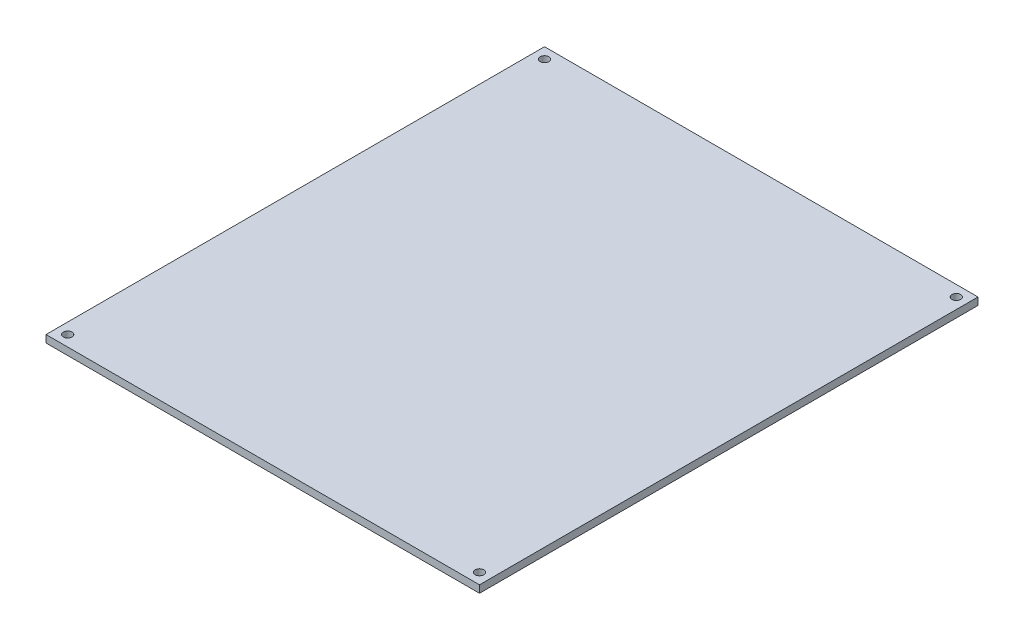
ISO-10303-21;
HEADER;
FILE_DESCRIPTION(('STEP AP214'),'2;1');
FILE_NAME('part.step','',(''),(''),'','','');
FILE_SCHEMA(('AUTOMOTIVE_DESIGN { 1 0 10303 214 1 1 1 1 }'));
ENDSEC;
DATA;
#1=APPLICATION_CONTEXT('core data for automotive mechanical design processes');
#2=APPLICATION_PROTOCOL_DEFINITION('international standard','automotive_design',2000,#1);
#3=PRODUCT_CONTEXT('',#1,'mechanical');
#4=PRODUCT('Part','Part','',(#3));
#5=PRODUCT_RELATED_PRODUCT_CATEGORY('part','',(#4));
#6=PRODUCT_DEFINITION_FORMATION('','',#4);
#7=PRODUCT_DEFINITION_CONTEXT('part definition',#1,'design');
#8=PRODUCT_DEFINITION('design','',#6,#7);
#9=PRODUCT_DEFINITION_SHAPE('','',#8);
#10=(LENGTH_UNIT() NAMED_UNIT(*) SI_UNIT(.MILLI.,.METRE.));
#11=(NAMED_UNIT(*) PLANE_ANGLE_UNIT() SI_UNIT($,.RADIAN.));
#12=(NAMED_UNIT(*) SI_UNIT($,.STERADIAN.) SOLID_ANGLE_UNIT());
#13=UNCERTAINTY_MEASURE_WITH_UNIT(LENGTH_MEASURE(1.E-05),#10,'distance_accuracy_value','');
#14=(GEOMETRIC_REPRESENTATION_CONTEXT(3) GLOBAL_UNCERTAINTY_ASSIGNED_CONTEXT((#13)) GLOBAL_UNIT_ASSIGNED_CONTEXT((#10,
#11,#12)) REPRESENTATION_CONTEXT('',''));
#15=CARTESIAN_POINT('',(0.,0.,0.));
#16=DIRECTION('',(0.,0.,1.));
#17=DIRECTION('',(1.,0.,0.));
#18=AXIS2_PLACEMENT_3D('',#15,#16,#17);
#19=CARTESIAN_POINT('',(50.,0.,-57.5));
#20=DIRECTION('',(-1.,0.,0.));
#21=DIRECTION('',(0.,0.,1.));
#22=AXIS2_PLACEMENT_3D('',#19,#20,#21);
#23=PLANE('',#22);
#24=DIRECTION('',(0.,1.,0.));
#25=VECTOR('',#24,1.);
#26=CARTESIAN_POINT('',(50.,0.85,-57.5));
#27=LINE('',#26,#25);
#28=CARTESIAN_POINT('',(50.,0.,-57.5));
#29=VERTEX_POINT('',#28);
#30=CARTESIAN_POINT('',(50.,1.7,-57.5));
#31=VERTEX_POINT('',#30);
#32=EDGE_CURVE('E67',#29,#31,#27,.T.);
#33=ORIENTED_EDGE('',*,*,#32,.T.);
#34=DIRECTION('',(0.,0.,1.));
#35=VECTOR('',#34,1.);
#36=CARTESIAN_POINT('',(50.,1.7,0.));
#37=LINE('',#36,#35);
#38=CARTESIAN_POINT('',(50.,1.7,57.5));
#39=VERTEX_POINT('',#38);
#40=EDGE_CURVE('E106',#31,#39,#37,.T.);
#41=ORIENTED_EDGE('',*,*,#40,.T.);
#42=DIRECTION('',(0.,-1.,0.));
#43=VECTOR('',#42,1.);
#44=CARTESIAN_POINT('',(50.,0.85,57.5));
#45=LINE('',#44,#43);
#46=CARTESIAN_POINT('',(50.,0.,57.5));
#47=VERTEX_POINT('',#46);
#48=EDGE_CURVE('E57',#39,#47,#45,.T.);
#49=ORIENTED_EDGE('',*,*,#48,.T.);
#50=DIRECTION('',(0.,0.,1.));
#51=VECTOR('',#50,1.);
#52=CARTESIAN_POINT('',(50.,0.,0.));
#53=LINE('',#52,#51);
#54=EDGE_CURVE('E100',#29,#47,#53,.T.);
#55=ORIENTED_EDGE('',*,*,#54,.F.);
#56=EDGE_LOOP('',(#33,#41,#49,#55));
#57=FACE_BOUND('',#56,.T.);
#58=ADVANCED_FACE('F17',(#57),#23,.F.);
#59=CARTESIAN_POINT('',(50.,0.,57.5));
#60=DIRECTION('',(0.,0.,-1.));
#61=DIRECTION('',(-1.,0.,0.));
#62=AXIS2_PLACEMENT_3D('',#59,#60,#61);
#63=PLANE('',#62);
#64=ORIENTED_EDGE('',*,*,#48,.F.);
#65=DIRECTION('',(-1.,0.,0.));
#66=VECTOR('',#65,1.);
#67=CARTESIAN_POINT('',(0.,1.7,57.5));
#68=LINE('',#67,#66);
#69=CARTESIAN_POINT('',(-50.,1.7,57.5));
#70=VERTEX_POINT('',#69);
#71=EDGE_CURVE('E73',#39,#70,#68,.T.);
#72=ORIENTED_EDGE('',*,*,#71,.T.);
#73=DIRECTION('',(0.,-1.,0.));
#74=VECTOR('',#73,1.);
#75=CARTESIAN_POINT('',(-50.,0.85,57.5));
#76=LINE('',#75,#74);
#77=CARTESIAN_POINT('',(-50.,0.,57.5));
#78=VERTEX_POINT('',#77);
#79=EDGE_CURVE('E63',#70,#78,#76,.T.);
#80=ORIENTED_EDGE('',*,*,#79,.T.);
#81=DIRECTION('',(-1.,0.,0.));
#82=VECTOR('',#81,1.);
#83=CARTESIAN_POINT('',(0.,0.,57.5));
#84=LINE('',#83,#82);
#85=EDGE_CURVE('E113',#47,#78,#84,.T.);
#86=ORIENTED_EDGE('',*,*,#85,.F.);
#87=EDGE_LOOP('',(#64,#72,#80,#86));
#88=FACE_BOUND('',#87,.T.);
#89=ADVANCED_FACE('F78',(#88),#63,.F.);
#90=CARTESIAN_POINT('',(-50.,0.,57.5));
#91=DIRECTION('',(1.,0.,0.));
#92=DIRECTION('',(0.,0.,-1.));
#93=AXIS2_PLACEMENT_3D('',#90,#91,#92);
#94=PLANE('',#93);
#95=ORIENTED_EDGE('',*,*,#79,.F.);
#96=DIRECTION('',(0.,0.,-1.));
#97=VECTOR('',#96,1.);
#98=CARTESIAN_POINT('',(-50.,1.7,0.));
#99=LINE('',#98,#97);
#100=CARTESIAN_POINT('',(-50.,1.7,-57.5));
#101=VERTEX_POINT('',#100);
#102=EDGE_CURVE('E66',#70,#101,#99,.T.);
#103=ORIENTED_EDGE('',*,*,#102,.T.);
#104=DIRECTION('',(0.,-1.,0.));
#105=VECTOR('',#104,1.);
#106=CARTESIAN_POINT('',(-50.,0.85,-57.5));
#107=LINE('',#106,#105);
#108=CARTESIAN_POINT('',(-50.,0.,-57.5));
#109=VERTEX_POINT('',#108);
#110=EDGE_CURVE('E79',#101,#109,#107,.T.);
#111=ORIENTED_EDGE('',*,*,#110,.T.);
#112=DIRECTION('',(0.,0.,-1.));
#113=VECTOR('',#112,1.);
#114=CARTESIAN_POINT('',(-50.,0.,0.));
#115=LINE('',#114,#113);
#116=EDGE_CURVE('E36',#78,#109,#115,.T.);
#117=ORIENTED_EDGE('',*,*,#116,.F.);
#118=EDGE_LOOP('',(#95,#103,#111,#117));
#119=FACE_BOUND('',#118,.T.);
#120=ADVANCED_FACE('F65',(#119),#94,.F.);
#121=CARTESIAN_POINT('',(-50.,0.,-57.5));
#122=DIRECTION('',(0.,0.,1.));
#123=DIRECTION('',(1.,0.,0.));
#124=AXIS2_PLACEMENT_3D('',#121,#122,#123);
#125=PLANE('',#124);
#126=ORIENTED_EDGE('',*,*,#110,.F.);
#127=DIRECTION('',(1.,0.,0.));
#128=VECTOR('',#127,1.);
#129=CARTESIAN_POINT('',(0.,1.7,-57.5));
#130=LINE('',#129,#128);
#131=EDGE_CURVE('E76',#101,#31,#130,.T.);
#132=ORIENTED_EDGE('',*,*,#131,.T.);
#133=ORIENTED_EDGE('',*,*,#32,.F.);
#134=DIRECTION('',(1.,0.,0.));
#135=VECTOR('',#134,1.);
#136=CARTESIAN_POINT('',(0.,0.,-57.5));
#137=LINE('',#136,#135);
#138=EDGE_CURVE('E97',#109,#29,#137,.T.);
#139=ORIENTED_EDGE('',*,*,#138,.F.);
#140=EDGE_LOOP('',(#126,#132,#133,#139));
#141=FACE_BOUND('',#140,.T.);
#142=ADVANCED_FACE('F119',(#141),#125,.F.);
#143=CARTESIAN_POINT('',(-47.5,1.7,-55.));
#144=DIRECTION('',(0.,-1.,0.));
#145=DIRECTION('',(0.,0.,-1.));
#146=AXIS2_PLACEMENT_3D('',#143,#144,#145);
#147=CYLINDRICAL_SURFACE('',#146,1.);
#148=CARTESIAN_POINT('',(-47.5,0.,-55.));
#149=DIRECTION('',(0.,-1.,0.));
#150=DIRECTION('',(0.,0.,-1.));
#151=AXIS2_PLACEMENT_3D('',#148,#149,#150);
#152=CIRCLE('',#151,1.);
#153=CARTESIAN_POINT('',(-47.5,0.,-56.));
#154=VERTEX_POINT('',#153);
#155=EDGE_CURVE('E94',#154,#154,#152,.F.);
#156=ORIENTED_EDGE('',*,*,#155,.F.);
#157=EDGE_LOOP('',(#156));
#158=FACE_BOUND('',#157,.T.);
#159=CARTESIAN_POINT('',(-47.5,1.7,-55.));
#160=DIRECTION('',(0.,-1.,0.));
#161=DIRECTION('',(0.,0.,-1.));
#162=AXIS2_PLACEMENT_3D('',#159,#160,#161);
#163=CIRCLE('',#162,1.);
#164=CARTESIAN_POINT('',(-47.5,1.7,-56.));
#165=VERTEX_POINT('',#164);
#166=EDGE_CURVE('E21',#165,#165,#163,.F.);
#167=ORIENTED_EDGE('',*,*,#166,.T.);
#168=EDGE_LOOP('',(#167));
#169=FACE_BOUND('',#168,.T.);
#170=ADVANCED_FACE('F121',(#158,#169),#147,.F.);
#171=CARTESIAN_POINT('',(-47.5,1.7,55.));
#172=DIRECTION('',(0.,-1.,0.));
#173=DIRECTION('',(0.,0.,-1.));
#174=AXIS2_PLACEMENT_3D('',#171,#172,#173);
#175=CYLINDRICAL_SURFACE('',#174,1.);
#176=CARTESIAN_POINT('',(-47.5,0.,55.));
#177=DIRECTION('',(0.,-1.,0.));
#178=DIRECTION('',(0.,0.,-1.));
#179=AXIS2_PLACEMENT_3D('',#176,#177,#178);
#180=CIRCLE('',#179,1.);
#181=CARTESIAN_POINT('',(-47.5,0.,54.));
#182=VERTEX_POINT('',#181);
#183=EDGE_CURVE('E91',#182,#182,#180,.F.);
#184=ORIENTED_EDGE('',*,*,#183,.F.);
#185=EDGE_LOOP('',(#184));
#186=FACE_BOUND('',#185,.T.);
#187=CARTESIAN_POINT('',(-47.5,1.7,55.));
#188=DIRECTION('',(0.,-1.,0.));
#189=DIRECTION('',(0.,0.,-1.));
#190=AXIS2_PLACEMENT_3D('',#187,#188,#189);
#191=CIRCLE('',#190,1.);
#192=CARTESIAN_POINT('',(-47.5,1.7,54.));
#193=VERTEX_POINT('',#192);
#194=EDGE_CURVE('E101',#193,#193,#191,.F.);
#195=ORIENTED_EDGE('',*,*,#194,.T.);
#196=EDGE_LOOP('',(#195));
#197=FACE_BOUND('',#196,.T.);
#198=ADVANCED_FACE('F128',(#186,#197),#175,.F.);
#199=CARTESIAN_POINT('',(47.5,1.7,55.));
#200=DIRECTION('',(0.,-1.,0.));
#201=DIRECTION('',(0.,0.,-1.));
#202=AXIS2_PLACEMENT_3D('',#199,#200,#201);
#203=CYLINDRICAL_SURFACE('',#202,1.);
#204=CARTESIAN_POINT('',(47.5,0.,55.));
#205=DIRECTION('',(0.,-1.,0.));
#206=DIRECTION('',(0.,0.,-1.));
#207=AXIS2_PLACEMENT_3D('',#204,#205,#206);
#208=CIRCLE('',#207,1.);
#209=CARTESIAN_POINT('',(47.5,0.,54.));
#210=VERTEX_POINT('',#209);
#211=EDGE_CURVE('E88',#210,#210,#208,.F.);
#212=ORIENTED_EDGE('',*,*,#211,.F.);
#213=EDGE_LOOP('',(#212));
#214=FACE_BOUND('',#213,.T.);
#215=CARTESIAN_POINT('',(47.5,1.7,55.));
#216=DIRECTION('',(0.,-1.,0.));
#217=DIRECTION('',(0.,0.,-1.));
#218=AXIS2_PLACEMENT_3D('',#215,#216,#217);
#219=CIRCLE('',#218,1.);
#220=CARTESIAN_POINT('',(47.5,1.7,54.));
#221=VERTEX_POINT('',#220);
#222=EDGE_CURVE('E98',#221,#221,#219,.F.);
#223=ORIENTED_EDGE('',*,*,#222,.T.);
#224=EDGE_LOOP('',(#223));
#225=FACE_BOUND('',#224,.T.);
#226=ADVANCED_FACE('F142',(#214,#225),#203,.F.);
#227=CARTESIAN_POINT('',(-50.,1.7,57.5));
#228=DIRECTION('',(0.,-1.,0.));
#229=DIRECTION('',(0.,0.,-1.));
#230=AXIS2_PLACEMENT_3D('',#227,#228,#229);
#231=PLANE('',#230);
#232=ORIENTED_EDGE('',*,*,#222,.F.);
#233=EDGE_LOOP('',(#232));
#234=FACE_BOUND('',#233,.T.);
#235=ORIENTED_EDGE('',*,*,#194,.F.);
#236=EDGE_LOOP('',(#235));
#237=FACE_BOUND('',#236,.T.);
#238=ORIENTED_EDGE('',*,*,#166,.F.);
#239=EDGE_LOOP('',(#238));
#240=FACE_BOUND('',#239,.T.);
#241=CARTESIAN_POINT('',(47.5,1.7,-55.));
#242=DIRECTION('',(0.,-1.,0.));
#243=DIRECTION('',(0.,0.,-1.));
#244=AXIS2_PLACEMENT_3D('',#241,#242,#243);
#245=CIRCLE('',#244,1.);
#246=CARTESIAN_POINT('',(47.5,1.7,-56.));
#247=VERTEX_POINT('',#246);
#248=EDGE_CURVE('E27',#247,#247,#245,.F.);
#249=ORIENTED_EDGE('',*,*,#248,.F.);
#250=EDGE_LOOP('',(#249));
#251=FACE_BOUND('',#250,.T.);
#252=ORIENTED_EDGE('',*,*,#131,.F.);
#253=ORIENTED_EDGE('',*,*,#102,.F.);
#254=ORIENTED_EDGE('',*,*,#71,.F.);
#255=ORIENTED_EDGE('',*,*,#40,.F.);
#256=EDGE_LOOP('',(#252,#253,#254,#255));
#257=FACE_BOUND('',#256,.T.);
#258=ADVANCED_FACE('F71',(#234,#237,#240,#251,#257),#231,.F.);
#259=CARTESIAN_POINT('',(-50.,0.,57.5));
#260=DIRECTION('',(0.,-1.,0.));
#261=DIRECTION('',(0.,0.,-1.));
#262=AXIS2_PLACEMENT_3D('',#259,#260,#261);
#263=PLANE('',#262);
#264=ORIENTED_EDGE('',*,*,#211,.T.);
#265=EDGE_LOOP('',(#264));
#266=FACE_BOUND('',#265,.T.);
#267=ORIENTED_EDGE('',*,*,#183,.T.);
#268=EDGE_LOOP('',(#267));
#269=FACE_BOUND('',#268,.T.);
#270=ORIENTED_EDGE('',*,*,#155,.T.);
#271=EDGE_LOOP('',(#270));
#272=FACE_BOUND('',#271,.T.);
#273=CARTESIAN_POINT('',(47.5,0.,-55.));
#274=DIRECTION('',(0.,-1.,0.));
#275=DIRECTION('',(0.,0.,-1.));
#276=AXIS2_PLACEMENT_3D('',#273,#274,#275);
#277=CIRCLE('',#276,1.);
#278=CARTESIAN_POINT('',(47.5,0.,-56.));
#279=VERTEX_POINT('',#278);
#280=EDGE_CURVE('E11',#279,#279,#277,.T.);
#281=ORIENTED_EDGE('',*,*,#280,.F.);
#282=EDGE_LOOP('',(#281));
#283=FACE_BOUND('',#282,.T.);
#284=ORIENTED_EDGE('',*,*,#116,.T.);
#285=ORIENTED_EDGE('',*,*,#138,.T.);
#286=ORIENTED_EDGE('',*,*,#54,.T.);
#287=ORIENTED_EDGE('',*,*,#85,.T.);
#288=EDGE_LOOP('',(#284,#285,#286,#287));
#289=FACE_BOUND('',#288,.T.);
#290=ADVANCED_FACE('F19',(#266,#269,#272,#283,#289),#263,.T.);
#291=CARTESIAN_POINT('',(47.5,1.7,-55.));
#292=DIRECTION('',(0.,-1.,0.));
#293=DIRECTION('',(0.,0.,-1.));
#294=AXIS2_PLACEMENT_3D('',#291,#292,#293);
#295=CYLINDRICAL_SURFACE('',#294,1.);
#296=ORIENTED_EDGE('',*,*,#248,.T.);
#297=EDGE_LOOP('',(#296));
#298=FACE_BOUND('',#297,.T.);
#299=ORIENTED_EDGE('',*,*,#280,.T.);
#300=EDGE_LOOP('',(#299));
#301=FACE_BOUND('',#300,.T.);
#302=ADVANCED_FACE('F132',(#298,#301),#295,.F.);
#303=CLOSED_SHELL('',(#58,#89,#120,#142,#170,#198,#226,#258,#290,#302));
#304=MANIFOLD_SOLID_BREP('B1',#303);
#305=ADVANCED_BREP_SHAPE_REPRESENTATION('',(#18,#304),#14);
#306=SHAPE_DEFINITION_REPRESENTATION(#9,#305);
ENDSEC;
END-ISO-10303-21;
